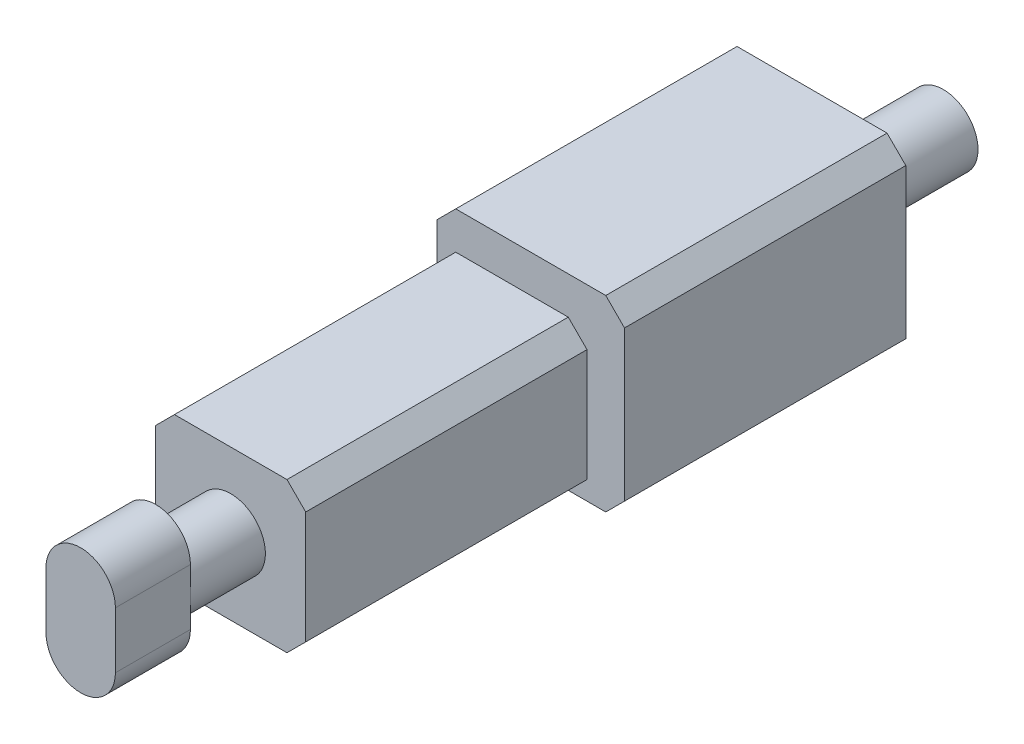
ISO-10303-21;
HEADER;
FILE_DESCRIPTION(('STEP AP214'),'2;1');
FILE_NAME('part.step','',(''),(''),'','','');
FILE_SCHEMA(('AUTOMOTIVE_DESIGN { 1 0 10303 214 1 1 1 1 }'));
ENDSEC;
DATA;
#1=APPLICATION_CONTEXT('core data for automotive mechanical design processes');
#2=APPLICATION_PROTOCOL_DEFINITION('international standard','automotive_design',2000,#1);
#3=PRODUCT_CONTEXT('',#1,'mechanical');
#4=PRODUCT('Part','Part','',(#3));
#5=PRODUCT_RELATED_PRODUCT_CATEGORY('part','',(#4));
#6=PRODUCT_DEFINITION_FORMATION('','',#4);
#7=PRODUCT_DEFINITION_CONTEXT('part definition',#1,'design');
#8=PRODUCT_DEFINITION('design','',#6,#7);
#9=PRODUCT_DEFINITION_SHAPE('','',#8);
#10=(LENGTH_UNIT() NAMED_UNIT(*) SI_UNIT(.MILLI.,.METRE.));
#11=(NAMED_UNIT(*) PLANE_ANGLE_UNIT() SI_UNIT($,.RADIAN.));
#12=(NAMED_UNIT(*) SI_UNIT($,.STERADIAN.) SOLID_ANGLE_UNIT());
#13=UNCERTAINTY_MEASURE_WITH_UNIT(LENGTH_MEASURE(1.E-05),#10,'distance_accuracy_value','');
#14=(GEOMETRIC_REPRESENTATION_CONTEXT(3) GLOBAL_UNCERTAINTY_ASSIGNED_CONTEXT((#13)) GLOBAL_UNIT_ASSIGNED_CONTEXT((#10,
#11,#12)) REPRESENTATION_CONTEXT('',''));
#15=CARTESIAN_POINT('',(0.,0.,0.));
#16=DIRECTION('',(0.,0.,1.));
#17=DIRECTION('',(1.,0.,0.));
#18=AXIS2_PLACEMENT_3D('',#15,#16,#17);
#19=CARTESIAN_POINT('',(2.,4.,7.5));
#20=DIRECTION('',(-1.,0.,0.));
#21=DIRECTION('',(0.,0.,1.));
#22=AXIS2_PLACEMENT_3D('',#19,#20,#21);
#23=PLANE('',#22);
#24=DIRECTION('',(0.,-1.,0.));
#25=VECTOR('',#24,1.);
#26=CARTESIAN_POINT('',(2.,4.,7.5));
#27=LINE('',#26,#25);
#28=CARTESIAN_POINT('',(2.,3.5,7.5));
#29=VERTEX_POINT('',#28);
#30=CARTESIAN_POINT('',(2.,0.5,7.5));
#31=VERTEX_POINT('',#30);
#32=EDGE_CURVE('E228',#29,#31,#27,.T.);
#33=ORIENTED_EDGE('',*,*,#32,.T.);
#34=DIRECTION('',(0.,0.,-1.));
#35=VECTOR('',#34,1.);
#36=CARTESIAN_POINT('',(2.,0.5,0.));
#37=LINE('',#36,#35);
#38=CARTESIAN_POINT('',(2.,0.5,0.));
#39=VERTEX_POINT('',#38);
#40=EDGE_CURVE('E321',#31,#39,#37,.T.);
#41=ORIENTED_EDGE('',*,*,#40,.T.);
#42=DIRECTION('',(0.,-1.,0.));
#43=VECTOR('',#42,1.);
#44=CARTESIAN_POINT('',(2.,4.,0.));
#45=LINE('',#44,#43);
#46=CARTESIAN_POINT('',(2.,3.5,0.));
#47=VERTEX_POINT('',#46);
#48=EDGE_CURVE('E336',#47,#39,#45,.T.);
#49=ORIENTED_EDGE('',*,*,#48,.F.);
#50=DIRECTION('',(0.,0.,1.));
#51=VECTOR('',#50,1.);
#52=CARTESIAN_POINT('',(2.,3.5,7.5));
#53=LINE('',#52,#51);
#54=EDGE_CURVE('E318',#47,#29,#53,.T.);
#55=ORIENTED_EDGE('',*,*,#54,.T.);
#56=EDGE_LOOP('',(#33,#41,#49,#55));
#57=FACE_BOUND('',#56,.T.);
#58=ADVANCED_FACE('F41',(#57),#23,.F.);
#59=CARTESIAN_POINT('',(0.,4.,0.));
#60=DIRECTION('',(0.,-1.,0.));
#61=DIRECTION('',(0.,0.,-1.));
#62=AXIS2_PLACEMENT_3D('',#59,#60,#61);
#63=PLANE('',#62);
#64=DIRECTION('',(1.,0.,0.));
#65=VECTOR('',#64,1.);
#66=CARTESIAN_POINT('',(0.,4.,0.));
#67=LINE('',#66,#65);
#68=CARTESIAN_POINT('',(-1.5,4.,0.));
#69=VERTEX_POINT('',#68);
#70=CARTESIAN_POINT('',(1.5,4.,0.));
#71=VERTEX_POINT('',#70);
#72=EDGE_CURVE('E385',#69,#71,#67,.T.);
#73=ORIENTED_EDGE('',*,*,#72,.F.);
#74=DIRECTION('',(0.,0.,1.));
#75=VECTOR('',#74,1.);
#76=CARTESIAN_POINT('',(-1.5,4.,0.));
#77=LINE('',#76,#75);
#78=CARTESIAN_POINT('',(-1.5,4.,7.5));
#79=VERTEX_POINT('',#78);
#80=EDGE_CURVE('E315',#69,#79,#77,.T.);
#81=ORIENTED_EDGE('',*,*,#80,.T.);
#82=DIRECTION('',(1.,0.,0.));
#83=VECTOR('',#82,1.);
#84=CARTESIAN_POINT('',(-2.,4.,7.5));
#85=LINE('',#84,#83);
#86=CARTESIAN_POINT('',(1.5,4.,7.5));
#87=VERTEX_POINT('',#86);
#88=EDGE_CURVE('E225',#79,#87,#85,.T.);
#89=ORIENTED_EDGE('',*,*,#88,.T.);
#90=DIRECTION('',(0.,0.,-1.));
#91=VECTOR('',#90,1.);
#92=CARTESIAN_POINT('',(1.5,4.,0.));
#93=LINE('',#92,#91);
#94=EDGE_CURVE('E311',#87,#71,#93,.T.);
#95=ORIENTED_EDGE('',*,*,#94,.T.);
#96=EDGE_LOOP('',(#73,#81,#89,#95));
#97=FACE_BOUND('',#96,.T.);
#98=ADVANCED_FACE('F460',(#97),#63,.F.);
#99=CARTESIAN_POINT('',(-2.,4.,-7.5));
#100=DIRECTION('',(0.,0.,1.));
#101=DIRECTION('',(1.,0.,0.));
#102=AXIS2_PLACEMENT_3D('',#99,#100,#101);
#103=PLANE('',#102);
#104=CARTESIAN_POINT('',(1.,2.83290341310044,-7.5));
#105=DIRECTION('',(0.,0.,1.));
#106=DIRECTION('',(1.,0.,0.));
#107=AXIS2_PLACEMENT_3D('',#104,#105,#106);
#108=CIRCLE('',#107,0.925);
#109=CARTESIAN_POINT('',(1.925,2.83290341310044,-7.5));
#110=VERTEX_POINT('',#109);
#111=EDGE_CURVE('E433',#110,#110,#108,.T.);
#112=ORIENTED_EDGE('',*,*,#111,.T.);
#113=EDGE_LOOP('',(#112));
#114=FACE_BOUND('',#113,.T.);
#115=DIRECTION('',(0.,1.,0.));
#116=VECTOR('',#115,1.);
#117=CARTESIAN_POINT('',(3.,0.,-7.5));
#118=LINE('',#117,#116);
#119=CARTESIAN_POINT('',(3.,0.5,-7.5));
#120=VERTEX_POINT('',#119);
#121=CARTESIAN_POINT('',(3.,4.5,-7.5));
#122=VERTEX_POINT('',#121);
#123=EDGE_CURVE('E375',#120,#122,#118,.T.);
#124=ORIENTED_EDGE('',*,*,#123,.F.);
#125=DIRECTION('',(0.707106781186545,0.70710678118655,0.));
#126=VECTOR('',#125,1.);
#127=CARTESIAN_POINT('',(2.5,0.,-7.5));
#128=LINE('',#127,#126);
#129=CARTESIAN_POINT('',(2.5,0.,-7.5));
#130=VERTEX_POINT('',#129);
#131=EDGE_CURVE('E280',#120,#130,#128,.F.);
#132=ORIENTED_EDGE('',*,*,#131,.T.);
#133=DIRECTION('',(-1.,0.,0.));
#134=VECTOR('',#133,1.);
#135=CARTESIAN_POINT('',(-2.,0.,-7.5));
#136=LINE('',#135,#134);
#137=CARTESIAN_POINT('',(-1.5,0.,-7.5));
#138=VERTEX_POINT('',#137);
#139=EDGE_CURVE('E218',#130,#138,#136,.T.);
#140=ORIENTED_EDGE('',*,*,#139,.T.);
#141=DIRECTION('',(-0.70710678118655,0.707106781186545,0.));
#142=VECTOR('',#141,1.);
#143=CARTESIAN_POINT('',(-2.,0.5,-7.5));
#144=LINE('',#143,#142);
#145=CARTESIAN_POINT('',(-2.,0.5,-7.5));
#146=VERTEX_POINT('',#145);
#147=EDGE_CURVE('E271',#138,#146,#144,.T.);
#148=ORIENTED_EDGE('',*,*,#147,.T.);
#149=DIRECTION('',(0.,-1.,0.));
#150=VECTOR('',#149,1.);
#151=CARTESIAN_POINT('',(-2.,4.,-7.5));
#152=LINE('',#151,#150);
#153=CARTESIAN_POINT('',(-2.,4.5,-7.5));
#154=VERTEX_POINT('',#153);
#155=EDGE_CURVE('E224',#154,#146,#152,.T.);
#156=ORIENTED_EDGE('',*,*,#155,.F.);
#157=DIRECTION('',(0.707106781186545,0.70710678118655,0.));
#158=VECTOR('',#157,1.);
#159=CARTESIAN_POINT('',(-1.5,5.,-7.5));
#160=LINE('',#159,#158);
#161=CARTESIAN_POINT('',(-1.5,5.,-7.5));
#162=VERTEX_POINT('',#161);
#163=EDGE_CURVE('E274',#154,#162,#160,.T.);
#164=ORIENTED_EDGE('',*,*,#163,.T.);
#165=DIRECTION('',(-1.,0.,0.));
#166=VECTOR('',#165,1.);
#167=CARTESIAN_POINT('',(-2.,5.,-7.5));
#168=LINE('',#167,#166);
#169=CARTESIAN_POINT('',(2.5,5.,-7.5));
#170=VERTEX_POINT('',#169);
#171=EDGE_CURVE('E372',#170,#162,#168,.T.);
#172=ORIENTED_EDGE('',*,*,#171,.F.);
#173=DIRECTION('',(-0.70710678118655,0.707106781186545,0.));
#174=VECTOR('',#173,1.);
#175=CARTESIAN_POINT('',(3.,4.5,-7.5));
#176=LINE('',#175,#174);
#177=EDGE_CURVE('E277',#170,#122,#176,.F.);
#178=ORIENTED_EDGE('',*,*,#177,.T.);
#179=EDGE_LOOP('',(#124,#132,#140,#148,#156,#164,#172,#178));
#180=FACE_BOUND('',#179,.T.);
#181=ADVANCED_FACE('F360',(#114,#180),#103,.F.);
#182=CARTESIAN_POINT('',(-2.,4.,7.5));
#183=DIRECTION('',(1.,0.,0.));
#184=DIRECTION('',(0.,0.,-1.));
#185=AXIS2_PLACEMENT_3D('',#182,#183,#184);
#186=PLANE('',#185);
#187=DIRECTION('',(0.,-1.,0.));
#188=VECTOR('',#187,1.);
#189=CARTESIAN_POINT('',(-2.,0.,0.));
#190=LINE('',#189,#188);
#191=CARTESIAN_POINT('',(-2.,4.5,0.));
#192=VERTEX_POINT('',#191);
#193=CARTESIAN_POINT('',(-2.,3.5,0.));
#194=VERTEX_POINT('',#193);
#195=EDGE_CURVE('E431',#192,#194,#190,.T.);
#196=ORIENTED_EDGE('',*,*,#195,.F.);
#197=DIRECTION('',(0.,0.,-1.));
#198=VECTOR('',#197,1.);
#199=CARTESIAN_POINT('',(-2.,4.5,-7.5));
#200=LINE('',#199,#198);
#201=EDGE_CURVE('E298',#192,#154,#200,.T.);
#202=ORIENTED_EDGE('',*,*,#201,.T.);
#203=ORIENTED_EDGE('',*,*,#155,.T.);
#204=DIRECTION('',(0.,0.,1.));
#205=VECTOR('',#204,1.);
#206=CARTESIAN_POINT('',(-2.,0.5,7.5));
#207=LINE('',#206,#205);
#208=CARTESIAN_POINT('',(-2.,0.5,7.5));
#209=VERTEX_POINT('',#208);
#210=EDGE_CURVE('E294',#146,#209,#207,.T.);
#211=ORIENTED_EDGE('',*,*,#210,.T.);
#212=DIRECTION('',(0.,-1.,0.));
#213=VECTOR('',#212,1.);
#214=CARTESIAN_POINT('',(-2.,4.,7.5));
#215=LINE('',#214,#213);
#216=CARTESIAN_POINT('',(-2.,3.5,7.5));
#217=VERTEX_POINT('',#216);
#218=EDGE_CURVE('E239',#217,#209,#215,.T.);
#219=ORIENTED_EDGE('',*,*,#218,.F.);
#220=DIRECTION('',(0.,0.,-1.));
#221=VECTOR('',#220,1.);
#222=CARTESIAN_POINT('',(-2.,3.5,7.5));
#223=LINE('',#222,#221);
#224=EDGE_CURVE('E290',#217,#194,#223,.T.);
#225=ORIENTED_EDGE('',*,*,#224,.T.);
#226=EDGE_LOOP('',(#196,#202,#203,#211,#219,#225));
#227=FACE_BOUND('',#226,.T.);
#228=ADVANCED_FACE('F354',(#227),#186,.F.);
#229=CARTESIAN_POINT('',(-2.,4.,7.5));
#230=DIRECTION('',(0.,0.,-1.));
#231=DIRECTION('',(-1.,0.,0.));
#232=AXIS2_PLACEMENT_3D('',#229,#230,#231);
#233=PLANE('',#232);
#234=CARTESIAN_POINT('',(0.,2.,7.5));
#235=DIRECTION('',(0.,0.,1.));
#236=DIRECTION('',(1.,0.,0.));
#237=AXIS2_PLACEMENT_3D('',#234,#235,#236);
#238=CIRCLE('',#237,0.925);
#239=CARTESIAN_POINT('',(0.925,2.,7.5));
#240=VERTEX_POINT('',#239);
#241=EDGE_CURVE('E219',#240,#240,#238,.T.);
#242=ORIENTED_EDGE('',*,*,#241,.F.);
#243=EDGE_LOOP('',(#242));
#244=FACE_BOUND('',#243,.T.);
#245=ORIENTED_EDGE('',*,*,#218,.T.);
#246=DIRECTION('',(0.70710678118655,-0.707106781186545,0.));
#247=VECTOR('',#246,1.);
#248=CARTESIAN_POINT('',(-2.,0.5,7.5));
#249=LINE('',#248,#247);
#250=CARTESIAN_POINT('',(-1.5,0.,7.5));
#251=VERTEX_POINT('',#250);
#252=EDGE_CURVE('E308',#209,#251,#249,.T.);
#253=ORIENTED_EDGE('',*,*,#252,.T.);
#254=DIRECTION('',(1.,0.,0.));
#255=VECTOR('',#254,1.);
#256=CARTESIAN_POINT('',(-2.,0.,7.5));
#257=LINE('',#256,#255);
#258=CARTESIAN_POINT('',(1.5,0.,7.5));
#259=VERTEX_POINT('',#258);
#260=EDGE_CURVE('E229',#251,#259,#257,.T.);
#261=ORIENTED_EDGE('',*,*,#260,.T.);
#262=DIRECTION('',(0.70710678118655,0.707106781186545,0.));
#263=VECTOR('',#262,1.);
#264=CARTESIAN_POINT('',(2.,0.5,7.5));
#265=LINE('',#264,#263);
#266=EDGE_CURVE('E303',#259,#31,#265,.T.);
#267=ORIENTED_EDGE('',*,*,#266,.T.);
#268=ORIENTED_EDGE('',*,*,#32,.F.);
#269=DIRECTION('',(0.707106781186545,-0.70710678118655,0.));
#270=VECTOR('',#269,1.);
#271=CARTESIAN_POINT('',(1.5,4.,7.5));
#272=LINE('',#271,#270);
#273=EDGE_CURVE('E58',#29,#87,#272,.F.);
#274=ORIENTED_EDGE('',*,*,#273,.T.);
#275=ORIENTED_EDGE('',*,*,#88,.F.);
#276=DIRECTION('',(0.707106781186545,0.70710678118655,0.));
#277=VECTOR('',#276,1.);
#278=CARTESIAN_POINT('',(-1.5,4.,7.5));
#279=LINE('',#278,#277);
#280=EDGE_CURVE('E66',#79,#217,#279,.F.);
#281=ORIENTED_EDGE('',*,*,#280,.T.);
#282=EDGE_LOOP('',(#245,#253,#261,#267,#268,#274,#275,#281));
#283=FACE_BOUND('',#282,.T.);
#284=ADVANCED_FACE('F346',(#244,#283),#233,.F.);
#285=CARTESIAN_POINT('',(0.,0.,0.));
#286=DIRECTION('',(0.,-1.,0.));
#287=DIRECTION('',(0.,0.,-1.));
#288=AXIS2_PLACEMENT_3D('',#285,#286,#287);
#289=PLANE('',#288);
#290=ORIENTED_EDGE('',*,*,#139,.F.);
#291=DIRECTION('',(0.,0.,1.));
#292=VECTOR('',#291,1.);
#293=CARTESIAN_POINT('',(2.5,0.,0.));
#294=LINE('',#293,#292);
#295=CARTESIAN_POINT('',(2.5,0.,0.));
#296=VERTEX_POINT('',#295);
#297=EDGE_CURVE('E251',#130,#296,#294,.T.);
#298=ORIENTED_EDGE('',*,*,#297,.T.);
#299=DIRECTION('',(1.,0.,0.));
#300=VECTOR('',#299,1.);
#301=CARTESIAN_POINT('',(-2.,0.,0.));
#302=LINE('',#301,#300);
#303=CARTESIAN_POINT('',(1.5,0.,0.));
#304=VERTEX_POINT('',#303);
#305=EDGE_CURVE('E334',#304,#296,#302,.T.);
#306=ORIENTED_EDGE('',*,*,#305,.F.);
#307=DIRECTION('',(0.,0.,1.));
#308=VECTOR('',#307,1.);
#309=CARTESIAN_POINT('',(1.5,0.,7.5));
#310=LINE('',#309,#308);
#311=EDGE_CURVE('E223',#304,#259,#310,.T.);
#312=ORIENTED_EDGE('',*,*,#311,.T.);
#313=ORIENTED_EDGE('',*,*,#260,.F.);
#314=DIRECTION('',(0.,0.,-1.));
#315=VECTOR('',#314,1.);
#316=CARTESIAN_POINT('',(-1.5,0.,-7.5));
#317=LINE('',#316,#315);
#318=EDGE_CURVE('E248',#251,#138,#317,.T.);
#319=ORIENTED_EDGE('',*,*,#318,.T.);
#320=EDGE_LOOP('',(#290,#298,#306,#312,#313,#319));
#321=FACE_BOUND('',#320,.T.);
#322=ADVANCED_FACE('F344',(#321),#289,.T.);
#323=CARTESIAN_POINT('',(0.,2.,9.5));
#324=DIRECTION('',(0.,0.,-1.));
#325=DIRECTION('',(-1.,0.,0.));
#326=AXIS2_PLACEMENT_3D('',#323,#324,#325);
#327=CYLINDRICAL_SURFACE('',#326,0.925);
#328=CARTESIAN_POINT('',(0.,2.,9.5));
#329=DIRECTION('',(0.,0.,1.));
#330=DIRECTION('',(1.,0.,0.));
#331=AXIS2_PLACEMENT_3D('',#328,#329,#330);
#332=CIRCLE('',#331,0.925);
#333=CARTESIAN_POINT('',(0.925,2.,9.5));
#334=VERTEX_POINT('',#333);
#335=CARTESIAN_POINT('',(-0.925,2.,9.5));
#336=VERTEX_POINT('',#335);
#337=EDGE_CURVE('E210',#334,#336,#332,.T.);
#338=ORIENTED_EDGE('',*,*,#337,.F.);
#339=EDGE_CURVE('E205',#336,#334,#332,.T.);
#340=ORIENTED_EDGE('',*,*,#339,.F.);
#341=EDGE_LOOP('',(#338,#340));
#342=FACE_BOUND('',#341,.T.);
#343=ORIENTED_EDGE('',*,*,#241,.T.);
#344=EDGE_LOOP('',(#343));
#345=FACE_BOUND('',#344,.T.);
#346=ADVANCED_FACE('F580',(#342,#345),#327,.T.);
#347=CARTESIAN_POINT('',(0.,1.25,9.5));
#348=DIRECTION('',(0.,0.,1.));
#349=DIRECTION('',(1.,0.,0.));
#350=AXIS2_PLACEMENT_3D('',#347,#348,#349);
#351=PLANE('',#350);
#352=DIRECTION('',(0.,1.,0.));
#353=VECTOR('',#352,1.);
#354=CARTESIAN_POINT('',(0.925,1.25,9.5));
#355=LINE('',#354,#353);
#356=CARTESIAN_POINT('',(0.925,2.75,9.5));
#357=VERTEX_POINT('',#356);
#358=EDGE_CURVE('E398',#334,#357,#355,.T.);
#359=ORIENTED_EDGE('',*,*,#358,.F.);
#360=ORIENTED_EDGE('',*,*,#337,.T.);
#361=DIRECTION('',(0.,-1.,0.));
#362=VECTOR('',#361,1.);
#363=CARTESIAN_POINT('',(-0.925,1.25,9.5));
#364=LINE('',#363,#362);
#365=CARTESIAN_POINT('',(-0.925,2.75,9.5));
#366=VERTEX_POINT('',#365);
#367=EDGE_CURVE('E199',#366,#336,#364,.T.);
#368=ORIENTED_EDGE('',*,*,#367,.F.);
#369=CARTESIAN_POINT('',(0.,2.75,9.5));
#370=DIRECTION('',(0.,0.,1.));
#371=DIRECTION('',(1.,0.,0.));
#372=AXIS2_PLACEMENT_3D('',#369,#370,#371);
#373=CIRCLE('',#372,0.925);
#374=EDGE_CURVE('E402',#357,#366,#373,.T.);
#375=ORIENTED_EDGE('',*,*,#374,.F.);
#376=EDGE_LOOP('',(#359,#360,#368,#375));
#377=FACE_BOUND('',#376,.T.);
#378=ADVANCED_FACE('F420',(#377),#351,.F.);
#379=CARTESIAN_POINT('',(-0.925,1.25,9.5));
#380=VERTEX_POINT('',#379);
#381=EDGE_CURVE('E405',#336,#380,#364,.T.);
#382=ORIENTED_EDGE('',*,*,#381,.F.);
#383=ORIENTED_EDGE('',*,*,#339,.T.);
#384=CARTESIAN_POINT('',(0.925,1.25,9.5));
#385=VERTEX_POINT('',#384);
#386=EDGE_CURVE('E399',#385,#334,#355,.T.);
#387=ORIENTED_EDGE('',*,*,#386,.F.);
#388=CARTESIAN_POINT('',(0.,1.25,9.5));
#389=DIRECTION('',(0.,0.,1.));
#390=DIRECTION('',(1.,0.,0.));
#391=AXIS2_PLACEMENT_3D('',#388,#389,#390);
#392=CIRCLE('',#391,0.925);
#393=EDGE_CURVE('E203',#380,#385,#392,.T.);
#394=ORIENTED_EDGE('',*,*,#393,.F.);
#395=EDGE_LOOP('',(#382,#383,#387,#394));
#396=FACE_BOUND('',#395,.T.);
#397=ADVANCED_FACE('F424',(#396),#351,.F.);
#398=CARTESIAN_POINT('',(0.,1.25,11.5));
#399=DIRECTION('',(0.,0.,-1.));
#400=DIRECTION('',(-1.,0.,0.));
#401=AXIS2_PLACEMENT_3D('',#398,#399,#400);
#402=CYLINDRICAL_SURFACE('',#401,0.925);
#403=ORIENTED_EDGE('',*,*,#393,.T.);
#404=DIRECTION('',(0.,0.,-1.));
#405=VECTOR('',#404,1.);
#406=CARTESIAN_POINT('',(0.925,1.25,11.5));
#407=LINE('',#406,#405);
#408=CARTESIAN_POINT('',(0.925,1.25,11.5));
#409=VERTEX_POINT('',#408);
#410=EDGE_CURVE('E181',#409,#385,#407,.T.);
#411=ORIENTED_EDGE('',*,*,#410,.F.);
#412=CARTESIAN_POINT('',(0.,1.25,11.5));
#413=DIRECTION('',(0.,0.,1.));
#414=DIRECTION('',(1.,0.,0.));
#415=AXIS2_PLACEMENT_3D('',#412,#413,#414);
#416=CIRCLE('',#415,0.925);
#417=CARTESIAN_POINT('',(-0.925,1.25,11.5));
#418=VERTEX_POINT('',#417);
#419=EDGE_CURVE('E189',#418,#409,#416,.T.);
#420=ORIENTED_EDGE('',*,*,#419,.F.);
#421=DIRECTION('',(0.,0.,-1.));
#422=VECTOR('',#421,1.);
#423=CARTESIAN_POINT('',(-0.925,1.25,11.5));
#424=LINE('',#423,#422);
#425=EDGE_CURVE('E395',#418,#380,#424,.T.);
#426=ORIENTED_EDGE('',*,*,#425,.T.);
#427=EDGE_LOOP('',(#403,#411,#420,#426));
#428=FACE_BOUND('',#427,.T.);
#429=ADVANCED_FACE('F201',(#428),#402,.T.);
#430=CARTESIAN_POINT('',(0.925,1.25,11.5));
#431=DIRECTION('',(-1.,0.,0.));
#432=DIRECTION('',(0.,-1.,0.));
#433=AXIS2_PLACEMENT_3D('',#430,#431,#432);
#434=PLANE('',#433);
#435=ORIENTED_EDGE('',*,*,#386,.T.);
#436=ORIENTED_EDGE('',*,*,#358,.T.);
#437=DIRECTION('',(0.,0.,-1.));
#438=VECTOR('',#437,1.);
#439=CARTESIAN_POINT('',(0.925,2.75,11.5));
#440=LINE('',#439,#438);
#441=CARTESIAN_POINT('',(0.925,2.75,11.5));
#442=VERTEX_POINT('',#441);
#443=EDGE_CURVE('E184',#442,#357,#440,.T.);
#444=ORIENTED_EDGE('',*,*,#443,.F.);
#445=DIRECTION('',(0.,1.,0.));
#446=VECTOR('',#445,1.);
#447=CARTESIAN_POINT('',(0.925,1.25,11.5));
#448=LINE('',#447,#446);
#449=EDGE_CURVE('E176',#409,#442,#448,.T.);
#450=ORIENTED_EDGE('',*,*,#449,.F.);
#451=ORIENTED_EDGE('',*,*,#410,.T.);
#452=EDGE_LOOP('',(#435,#436,#444,#450,#451));
#453=FACE_BOUND('',#452,.T.);
#454=ADVANCED_FACE('F179',(#453),#434,.F.);
#455=CARTESIAN_POINT('',(0.,2.75,11.5));
#456=DIRECTION('',(0.,0.,-1.));
#457=DIRECTION('',(-1.,0.,0.));
#458=AXIS2_PLACEMENT_3D('',#455,#456,#457);
#459=CYLINDRICAL_SURFACE('',#458,0.925);
#460=ORIENTED_EDGE('',*,*,#374,.T.);
#461=DIRECTION('',(0.,0.,-1.));
#462=VECTOR('',#461,1.);
#463=CARTESIAN_POINT('',(-0.925,2.75,11.5));
#464=LINE('',#463,#462);
#465=CARTESIAN_POINT('',(-0.925,2.75,11.5));
#466=VERTEX_POINT('',#465);
#467=EDGE_CURVE('E212',#466,#366,#464,.T.);
#468=ORIENTED_EDGE('',*,*,#467,.F.);
#469=CARTESIAN_POINT('',(0.,2.75,11.5));
#470=DIRECTION('',(0.,0.,1.));
#471=DIRECTION('',(1.,0.,0.));
#472=AXIS2_PLACEMENT_3D('',#469,#470,#471);
#473=CIRCLE('',#472,0.925);
#474=EDGE_CURVE('E188',#442,#466,#473,.T.);
#475=ORIENTED_EDGE('',*,*,#474,.F.);
#476=ORIENTED_EDGE('',*,*,#443,.T.);
#477=EDGE_LOOP('',(#460,#468,#475,#476));
#478=FACE_BOUND('',#477,.T.);
#479=ADVANCED_FACE('F651',(#478),#459,.T.);
#480=CARTESIAN_POINT('',(-0.925,1.25,11.5));
#481=DIRECTION('',(1.,0.,0.));
#482=DIRECTION('',(0.,1.,0.));
#483=AXIS2_PLACEMENT_3D('',#480,#481,#482);
#484=PLANE('',#483);
#485=ORIENTED_EDGE('',*,*,#367,.T.);
#486=ORIENTED_EDGE('',*,*,#381,.T.);
#487=ORIENTED_EDGE('',*,*,#425,.F.);
#488=DIRECTION('',(0.,-1.,0.));
#489=VECTOR('',#488,1.);
#490=CARTESIAN_POINT('',(-0.925,1.25,11.5));
#491=LINE('',#490,#489);
#492=EDGE_CURVE('E194',#466,#418,#491,.T.);
#493=ORIENTED_EDGE('',*,*,#492,.F.);
#494=ORIENTED_EDGE('',*,*,#467,.T.);
#495=EDGE_LOOP('',(#485,#486,#487,#493,#494));
#496=FACE_BOUND('',#495,.T.);
#497=ADVANCED_FACE('F415',(#496),#484,.F.);
#498=CARTESIAN_POINT('',(0.,1.25,11.5));
#499=DIRECTION('',(0.,0.,1.));
#500=DIRECTION('',(1.,0.,0.));
#501=AXIS2_PLACEMENT_3D('',#498,#499,#500);
#502=PLANE('',#501);
#503=ORIENTED_EDGE('',*,*,#419,.T.);
#504=ORIENTED_EDGE('',*,*,#449,.T.);
#505=ORIENTED_EDGE('',*,*,#474,.T.);
#506=ORIENTED_EDGE('',*,*,#492,.T.);
#507=EDGE_LOOP('',(#503,#504,#505,#506));
#508=FACE_BOUND('',#507,.T.);
#509=ADVANCED_FACE('F192',(#508),#502,.T.);
#510=CARTESIAN_POINT('',(0.,0.,0.));
#511=DIRECTION('',(0.,0.,-1.));
#512=DIRECTION('',(-1.,0.,0.));
#513=AXIS2_PLACEMENT_3D('',#510,#511,#512);
#514=PLANE('',#513);
#515=ORIENTED_EDGE('',*,*,#305,.T.);
#516=DIRECTION('',(-0.707106781186545,-0.70710678118655,0.));
#517=VECTOR('',#516,1.);
#518=CARTESIAN_POINT('',(2.5,0.,0.));
#519=LINE('',#518,#517);
#520=CARTESIAN_POINT('',(3.,0.5,0.));
#521=VERTEX_POINT('',#520);
#522=EDGE_CURVE('E261',#296,#521,#519,.F.);
#523=ORIENTED_EDGE('',*,*,#522,.T.);
#524=DIRECTION('',(0.,1.,0.));
#525=VECTOR('',#524,1.);
#526=CARTESIAN_POINT('',(3.,0.,0.));
#527=LINE('',#526,#525);
#528=CARTESIAN_POINT('',(3.,4.5,0.));
#529=VERTEX_POINT('',#528);
#530=EDGE_CURVE('E376',#521,#529,#527,.T.);
#531=ORIENTED_EDGE('',*,*,#530,.T.);
#532=DIRECTION('',(0.70710678118655,-0.707106781186545,0.));
#533=VECTOR('',#532,1.);
#534=CARTESIAN_POINT('',(3.,4.5,0.));
#535=LINE('',#534,#533);
#536=CARTESIAN_POINT('',(2.5,5.,0.));
#537=VERTEX_POINT('',#536);
#538=EDGE_CURVE('E258',#529,#537,#535,.F.);
#539=ORIENTED_EDGE('',*,*,#538,.T.);
#540=DIRECTION('',(-1.,0.,0.));
#541=VECTOR('',#540,1.);
#542=CARTESIAN_POINT('',(-2.,5.,0.));
#543=LINE('',#542,#541);
#544=CARTESIAN_POINT('',(-1.5,5.,0.));
#545=VERTEX_POINT('',#544);
#546=EDGE_CURVE('E370',#537,#545,#543,.T.);
#547=ORIENTED_EDGE('',*,*,#546,.T.);
#548=DIRECTION('',(-0.707106781186545,-0.70710678118655,0.));
#549=VECTOR('',#548,1.);
#550=CARTESIAN_POINT('',(-1.5,5.,0.));
#551=LINE('',#550,#549);
#552=EDGE_CURVE('E255',#545,#192,#551,.T.);
#553=ORIENTED_EDGE('',*,*,#552,.T.);
#554=ORIENTED_EDGE('',*,*,#195,.T.);
#555=DIRECTION('',(-0.707106781186545,-0.70710678118655,0.));
#556=VECTOR('',#555,1.);
#557=CARTESIAN_POINT('',(-2.75,2.74999999999999,0.));
#558=LINE('',#557,#556);
#559=EDGE_CURVE('E325',#194,#69,#558,.F.);
#560=ORIENTED_EDGE('',*,*,#559,.T.);
#561=ORIENTED_EDGE('',*,*,#72,.T.);
#562=DIRECTION('',(-0.707106781186545,0.70710678118655,0.));
#563=VECTOR('',#562,1.);
#564=CARTESIAN_POINT('',(2.75,2.74999999999999,0.));
#565=LINE('',#564,#563);
#566=EDGE_CURVE('E11',#71,#47,#565,.F.);
#567=ORIENTED_EDGE('',*,*,#566,.T.);
#568=ORIENTED_EDGE('',*,*,#48,.T.);
#569=DIRECTION('',(-0.70710678118655,-0.707106781186545,0.));
#570=VECTOR('',#569,1.);
#571=CARTESIAN_POINT('',(0.749999999999993,-0.749999999999998,0.));
#572=LINE('',#571,#570);
#573=EDGE_CURVE('E51',#39,#304,#572,.T.);
#574=ORIENTED_EDGE('',*,*,#573,.T.);
#575=EDGE_LOOP('',(#515,#523,#531,#539,#547,#553,#554,#560,#561,#567,#568,#574));
#576=FACE_BOUND('',#575,.T.);
#577=ADVANCED_FACE('F333',(#576),#514,.F.);
#578=CARTESIAN_POINT('',(-2.,5.,-7.5));
#579=DIRECTION('',(0.,1.,0.));
#580=DIRECTION('',(0.,0.,1.));
#581=AXIS2_PLACEMENT_3D('',#578,#579,#580);
#582=PLANE('',#581);
#583=ORIENTED_EDGE('',*,*,#546,.F.);
#584=DIRECTION('',(0.,0.,-1.));
#585=VECTOR('',#584,1.);
#586=CARTESIAN_POINT('',(2.5,5.,-7.5));
#587=LINE('',#586,#585);
#588=EDGE_CURVE('E287',#537,#170,#587,.T.);
#589=ORIENTED_EDGE('',*,*,#588,.T.);
#590=ORIENTED_EDGE('',*,*,#171,.T.);
#591=DIRECTION('',(0.,0.,1.));
#592=VECTOR('',#591,1.);
#593=CARTESIAN_POINT('',(-1.5,5.,0.));
#594=LINE('',#593,#592);
#595=EDGE_CURVE('E283',#162,#545,#594,.T.);
#596=ORIENTED_EDGE('',*,*,#595,.T.);
#597=EDGE_LOOP('',(#583,#589,#590,#596));
#598=FACE_BOUND('',#597,.T.);
#599=ADVANCED_FACE('F369',(#598),#582,.T.);
#600=CARTESIAN_POINT('',(3.,0.,-7.5));
#601=DIRECTION('',(1.,0.,0.));
#602=DIRECTION('',(0.,0.,-1.));
#603=AXIS2_PLACEMENT_3D('',#600,#601,#602);
#604=PLANE('',#603);
#605=ORIENTED_EDGE('',*,*,#530,.F.);
#606=DIRECTION('',(0.,0.,-1.));
#607=VECTOR('',#606,1.);
#608=CARTESIAN_POINT('',(3.,0.5,-7.5));
#609=LINE('',#608,#607);
#610=EDGE_CURVE('E268',#521,#120,#609,.T.);
#611=ORIENTED_EDGE('',*,*,#610,.T.);
#612=ORIENTED_EDGE('',*,*,#123,.T.);
#613=DIRECTION('',(0.,0.,1.));
#614=VECTOR('',#613,1.);
#615=CARTESIAN_POINT('',(3.,4.5,-7.5));
#616=LINE('',#615,#614);
#617=EDGE_CURVE('E264',#122,#529,#616,.T.);
#618=ORIENTED_EDGE('',*,*,#617,.T.);
#619=EDGE_LOOP('',(#605,#611,#612,#618));
#620=FACE_BOUND('',#619,.T.);
#621=ADVANCED_FACE('F457',(#620),#604,.T.);
#622=CARTESIAN_POINT('',(1.,2.83290341310044,-10.5));
#623=DIRECTION('',(0.,0.,1.));
#624=DIRECTION('',(1.,0.,0.));
#625=AXIS2_PLACEMENT_3D('',#622,#623,#624);
#626=CYLINDRICAL_SURFACE('',#625,0.925);
#627=CARTESIAN_POINT('',(1.,2.83290341310044,-10.5));
#628=DIRECTION('',(0.,0.,1.));
#629=DIRECTION('',(1.,0.,0.));
#630=AXIS2_PLACEMENT_3D('',#627,#628,#629);
#631=CIRCLE('',#630,0.925);
#632=CARTESIAN_POINT('',(1.925,2.83290341310044,-10.5));
#633=VERTEX_POINT('',#632);
#634=EDGE_CURVE('E438',#633,#633,#631,.T.);
#635=ORIENTED_EDGE('',*,*,#634,.T.);
#636=EDGE_LOOP('',(#635));
#637=FACE_BOUND('',#636,.T.);
#638=ORIENTED_EDGE('',*,*,#111,.F.);
#639=EDGE_LOOP('',(#638));
#640=FACE_BOUND('',#639,.T.);
#641=ADVANCED_FACE('F443',(#637,#640),#626,.T.);
#642=CARTESIAN_POINT('',(1.,2.83290341310044,-10.5));
#643=DIRECTION('',(0.,0.,1.));
#644=DIRECTION('',(1.,0.,0.));
#645=AXIS2_PLACEMENT_3D('',#642,#643,#644);
#646=PLANE('',#645);
#647=ORIENTED_EDGE('',*,*,#634,.F.);
#648=EDGE_LOOP('',(#647));
#649=FACE_BOUND('',#648,.T.);
#650=ADVANCED_FACE('F446',(#649),#646,.F.);
#651=CARTESIAN_POINT('',(2.5,0.,0.));
#652=DIRECTION('',(-0.70710678118655,0.707106781186545,0.));
#653=DIRECTION('',(0.,0.,1.));
#654=AXIS2_PLACEMENT_3D('',#651,#652,#653);
#655=PLANE('',#654);
#656=ORIENTED_EDGE('',*,*,#131,.F.);
#657=ORIENTED_EDGE('',*,*,#610,.F.);
#658=ORIENTED_EDGE('',*,*,#522,.F.);
#659=ORIENTED_EDGE('',*,*,#297,.F.);
#660=EDGE_LOOP('',(#656,#657,#658,#659));
#661=FACE_BOUND('',#660,.T.);
#662=ADVANCED_FACE('F448',(#661),#655,.F.);
#663=CARTESIAN_POINT('',(3.,4.5,-7.5));
#664=DIRECTION('',(-0.707106781186545,-0.70710678118655,0.));
#665=DIRECTION('',(0.,0.,1.));
#666=AXIS2_PLACEMENT_3D('',#663,#664,#665);
#667=PLANE('',#666);
#668=ORIENTED_EDGE('',*,*,#177,.F.);
#669=ORIENTED_EDGE('',*,*,#588,.F.);
#670=ORIENTED_EDGE('',*,*,#538,.F.);
#671=ORIENTED_EDGE('',*,*,#617,.F.);
#672=EDGE_LOOP('',(#668,#669,#670,#671));
#673=FACE_BOUND('',#672,.T.);
#674=ADVANCED_FACE('F454',(#673),#667,.F.);
#675=CARTESIAN_POINT('',(-1.5,5.,-7.5));
#676=DIRECTION('',(-0.70710678118655,0.707106781186545,0.));
#677=DIRECTION('',(0.,0.,-1.));
#678=AXIS2_PLACEMENT_3D('',#675,#676,#677);
#679=PLANE('',#678);
#680=ORIENTED_EDGE('',*,*,#163,.F.);
#681=ORIENTED_EDGE('',*,*,#201,.F.);
#682=ORIENTED_EDGE('',*,*,#552,.F.);
#683=ORIENTED_EDGE('',*,*,#595,.F.);
#684=EDGE_LOOP('',(#680,#681,#682,#683));
#685=FACE_BOUND('',#684,.T.);
#686=ADVANCED_FACE('F365',(#685),#679,.T.);
#687=CARTESIAN_POINT('',(-2.,0.5,7.5));
#688=DIRECTION('',(-0.707106781186545,-0.70710678118655,0.));
#689=DIRECTION('',(0.,0.,-1.));
#690=AXIS2_PLACEMENT_3D('',#687,#688,#689);
#691=PLANE('',#690);
#692=ORIENTED_EDGE('',*,*,#147,.F.);
#693=ORIENTED_EDGE('',*,*,#318,.F.);
#694=ORIENTED_EDGE('',*,*,#252,.F.);
#695=ORIENTED_EDGE('',*,*,#210,.F.);
#696=EDGE_LOOP('',(#692,#693,#694,#695));
#697=FACE_BOUND('',#696,.T.);
#698=ADVANCED_FACE('F351',(#697),#691,.T.);
#699=CARTESIAN_POINT('',(-1.5,4.,0.));
#700=DIRECTION('',(0.70710678118655,-0.707106781186545,0.));
#701=DIRECTION('',(0.,0.,1.));
#702=AXIS2_PLACEMENT_3D('',#699,#700,#701);
#703=PLANE('',#702);
#704=ORIENTED_EDGE('',*,*,#559,.F.);
#705=ORIENTED_EDGE('',*,*,#224,.F.);
#706=ORIENTED_EDGE('',*,*,#280,.F.);
#707=ORIENTED_EDGE('',*,*,#80,.F.);
#708=EDGE_LOOP('',(#704,#705,#706,#707));
#709=FACE_BOUND('',#708,.T.);
#710=ADVANCED_FACE('F491',(#709),#703,.F.);
#711=CARTESIAN_POINT('',(2.,0.5,7.5));
#712=DIRECTION('',(0.707106781186545,-0.70710678118655,0.));
#713=DIRECTION('',(0.,0.,1.));
#714=AXIS2_PLACEMENT_3D('',#711,#712,#713);
#715=PLANE('',#714);
#716=ORIENTED_EDGE('',*,*,#266,.F.);
#717=ORIENTED_EDGE('',*,*,#311,.F.);
#718=ORIENTED_EDGE('',*,*,#573,.F.);
#719=ORIENTED_EDGE('',*,*,#40,.F.);
#720=EDGE_LOOP('',(#716,#717,#718,#719));
#721=FACE_BOUND('',#720,.T.);
#722=ADVANCED_FACE('F340',(#721),#715,.T.);
#723=CARTESIAN_POINT('',(1.5,4.,0.));
#724=DIRECTION('',(-0.70710678118655,-0.707106781186545,0.));
#725=DIRECTION('',(0.,0.,-1.));
#726=AXIS2_PLACEMENT_3D('',#723,#724,#725);
#727=PLANE('',#726);
#728=ORIENTED_EDGE('',*,*,#273,.F.);
#729=ORIENTED_EDGE('',*,*,#54,.F.);
#730=ORIENTED_EDGE('',*,*,#566,.F.);
#731=ORIENTED_EDGE('',*,*,#94,.F.);
#732=EDGE_LOOP('',(#728,#729,#730,#731));
#733=FACE_BOUND('',#732,.T.);
#734=ADVANCED_FACE('F44',(#733),#727,.F.);
#735=CLOSED_SHELL('',(#58,#98,#181,#228,#284,#322,#346,#378,#397,#429,#454,#479,#497,#509,#577,
#599,#621,#641,#650,#662,#674,#686,#698,#710,#722,#734));
#736=MANIFOLD_SOLID_BREP('B2',#735);
#737=ADVANCED_BREP_SHAPE_REPRESENTATION('',(#18,#736),#14);
#738=SHAPE_DEFINITION_REPRESENTATION(#9,#737);
ENDSEC;
END-ISO-10303-21;
